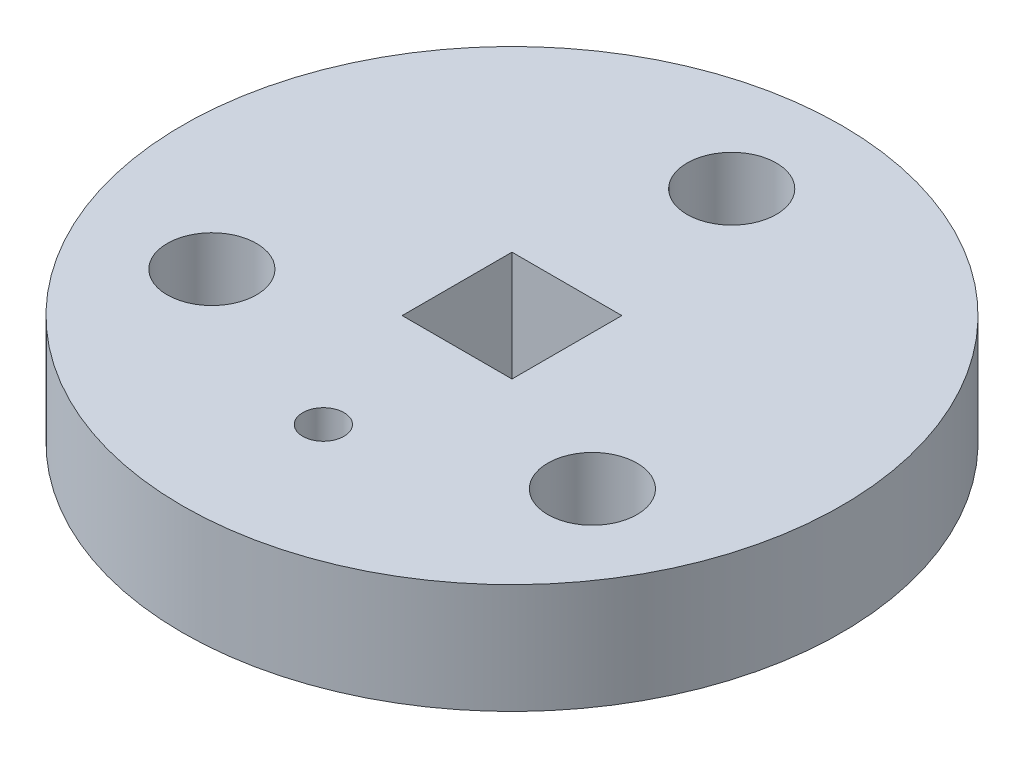
ISO-10303-21;
HEADER;
FILE_DESCRIPTION(('STEP AP214'),'2;1');
FILE_NAME('part.step','',(''),(''),'','','');
FILE_SCHEMA(('AUTOMOTIVE_DESIGN { 1 0 10303 214 1 1 1 1 }'));
ENDSEC;
DATA;
#1=APPLICATION_CONTEXT('core data for automotive mechanical design processes');
#2=APPLICATION_PROTOCOL_DEFINITION('international standard','automotive_design',2000,#1);
#3=PRODUCT_CONTEXT('',#1,'mechanical');
#4=PRODUCT('Part','Part','',(#3));
#5=PRODUCT_RELATED_PRODUCT_CATEGORY('part','',(#4));
#6=PRODUCT_DEFINITION_FORMATION('','',#4);
#7=PRODUCT_DEFINITION_CONTEXT('part definition',#1,'design');
#8=PRODUCT_DEFINITION('design','',#6,#7);
#9=PRODUCT_DEFINITION_SHAPE('','',#8);
#10=(LENGTH_UNIT() NAMED_UNIT(*) SI_UNIT(.MILLI.,.METRE.));
#11=(NAMED_UNIT(*) PLANE_ANGLE_UNIT() SI_UNIT($,.RADIAN.));
#12=(NAMED_UNIT(*) SI_UNIT($,.STERADIAN.) SOLID_ANGLE_UNIT());
#13=UNCERTAINTY_MEASURE_WITH_UNIT(LENGTH_MEASURE(1.E-05),#10,'distance_accuracy_value','');
#14=(GEOMETRIC_REPRESENTATION_CONTEXT(3) GLOBAL_UNCERTAINTY_ASSIGNED_CONTEXT((#13)) GLOBAL_UNIT_ASSIGNED_CONTEXT((#10,
#11,#12)) REPRESENTATION_CONTEXT('',''));
#15=CARTESIAN_POINT('',(0.,0.,0.));
#16=DIRECTION('',(0.,0.,1.));
#17=DIRECTION('',(1.,0.,0.));
#18=AXIS2_PLACEMENT_3D('',#15,#16,#17);
#19=CARTESIAN_POINT('',(0.,6.35,0.));
#20=DIRECTION('',(0.,1.,0.));
#21=DIRECTION('',(0.,0.,1.));
#22=AXIS2_PLACEMENT_3D('',#19,#20,#21);
#23=PLANE('',#22);
#24=CARTESIAN_POINT('',(10.9985226280624,6.35,6.35));
#25=DIRECTION('',(0.,1.,0.));
#26=DIRECTION('',(0.,0.,1.));
#27=AXIS2_PLACEMENT_3D('',#24,#25,#26);
#28=CIRCLE('',#27,2.5796875);
#29=CARTESIAN_POINT('',(10.9985226280624,6.35,8.9296875));
#30=VERTEX_POINT('',#29);
#31=EDGE_CURVE('E140',#30,#30,#28,.T.);
#32=ORIENTED_EDGE('',*,*,#31,.F.);
#33=EDGE_LOOP('',(#32));
#34=FACE_BOUND('',#33,.T.);
#35=DIRECTION('',(-1.,0.,0.));
#36=VECTOR('',#35,1.);
#37=CARTESIAN_POINT('',(3.175,6.35,-3.175));
#38=LINE('',#37,#36);
#39=CARTESIAN_POINT('',(3.175,6.35,-3.175));
#40=VERTEX_POINT('',#39);
#41=CARTESIAN_POINT('',(-3.175,6.35,-3.175));
#42=VERTEX_POINT('',#41);
#43=EDGE_CURVE('E82',#40,#42,#38,.T.);
#44=ORIENTED_EDGE('',*,*,#43,.F.);
#45=DIRECTION('',(0.,0.,-1.));
#46=VECTOR('',#45,1.);
#47=CARTESIAN_POINT('',(3.175,6.35,3.175));
#48=LINE('',#47,#46);
#49=CARTESIAN_POINT('',(3.175,6.35,3.175));
#50=VERTEX_POINT('',#49);
#51=EDGE_CURVE('E74',#50,#40,#48,.T.);
#52=ORIENTED_EDGE('',*,*,#51,.F.);
#53=DIRECTION('',(1.,0.,0.));
#54=VECTOR('',#53,1.);
#55=CARTESIAN_POINT('',(3.175,6.35,3.175));
#56=LINE('',#55,#54);
#57=CARTESIAN_POINT('',(-3.175,6.35,3.175));
#58=VERTEX_POINT('',#57);
#59=EDGE_CURVE('E97',#58,#50,#56,.T.);
#60=ORIENTED_EDGE('',*,*,#59,.F.);
#61=DIRECTION('',(0.,0.,1.));
#62=VECTOR('',#61,1.);
#63=CARTESIAN_POINT('',(-3.175,6.35,3.175));
#64=LINE('',#63,#62);
#65=EDGE_CURVE('E95',#42,#58,#64,.T.);
#66=ORIENTED_EDGE('',*,*,#65,.F.);
#67=EDGE_LOOP('',(#44,#52,#60,#66));
#68=FACE_BOUND('',#67,.T.);
#69=CARTESIAN_POINT('',(0.,6.35,-12.7));
#70=DIRECTION('',(0.,1.,0.));
#71=DIRECTION('',(0.,0.,1.));
#72=AXIS2_PLACEMENT_3D('',#69,#70,#71);
#73=CIRCLE('',#72,2.5796875);
#74=CARTESIAN_POINT('',(0.,6.35,-10.1203125));
#75=VERTEX_POINT('',#74);
#76=EDGE_CURVE('E113',#75,#75,#73,.T.);
#77=ORIENTED_EDGE('',*,*,#76,.F.);
#78=EDGE_LOOP('',(#77));
#79=FACE_BOUND('',#78,.T.);
#80=CARTESIAN_POINT('',(0.,6.35,0.));
#81=DIRECTION('',(0.,1.,0.));
#82=DIRECTION('',(0.,0.,1.));
#83=AXIS2_PLACEMENT_3D('',#80,#81,#82);
#84=CIRCLE('',#83,19.05);
#85=CARTESIAN_POINT('',(0.,6.35,19.05));
#86=VERTEX_POINT('',#85);
#87=EDGE_CURVE('E11',#86,#86,#84,.T.);
#88=ORIENTED_EDGE('',*,*,#87,.T.);
#89=EDGE_LOOP('',(#88));
#90=FACE_BOUND('',#89,.T.);
#91=CARTESIAN_POINT('',(0.,6.35,10.903378281309));
#92=DIRECTION('',(0.,1.,0.));
#93=DIRECTION('',(0.,0.,1.));
#94=AXIS2_PLACEMENT_3D('',#91,#92,#93);
#95=CIRCLE('',#94,1.190625);
#96=CARTESIAN_POINT('',(0.,6.35,12.094003281309));
#97=VERTEX_POINT('',#96);
#98=EDGE_CURVE('E103',#97,#97,#95,.T.);
#99=ORIENTED_EDGE('',*,*,#98,.F.);
#100=EDGE_LOOP('',(#99));
#101=FACE_BOUND('',#100,.T.);
#102=CARTESIAN_POINT('',(-10.9985226280624,6.35,6.35000000000001));
#103=DIRECTION('',(0.,1.,0.));
#104=DIRECTION('',(0.,0.,1.));
#105=AXIS2_PLACEMENT_3D('',#102,#103,#104);
#106=CIRCLE('',#105,2.5796875);
#107=CARTESIAN_POINT('',(-10.9985226280624,6.35,8.92968750000001));
#108=VERTEX_POINT('',#107);
#109=EDGE_CURVE('E147',#108,#108,#106,.T.);
#110=ORIENTED_EDGE('',*,*,#109,.F.);
#111=EDGE_LOOP('',(#110));
#112=FACE_BOUND('',#111,.T.);
#113=ADVANCED_FACE('F33',(#34,#68,#79,#90,#101,#112),#23,.T.);
#114=CARTESIAN_POINT('',(0.,0.,0.));
#115=DIRECTION('',(0.,1.,0.));
#116=DIRECTION('',(0.,0.,1.));
#117=AXIS2_PLACEMENT_3D('',#114,#115,#116);
#118=PLANE('',#117);
#119=CARTESIAN_POINT('',(0.,0.,-12.7));
#120=DIRECTION('',(0.,1.,0.));
#121=DIRECTION('',(0.,0.,1.));
#122=AXIS2_PLACEMENT_3D('',#119,#120,#121);
#123=CIRCLE('',#122,2.5796875);
#124=CARTESIAN_POINT('',(0.,0.,-10.1203125));
#125=VERTEX_POINT('',#124);
#126=EDGE_CURVE('E90',#125,#125,#123,.T.);
#127=ORIENTED_EDGE('',*,*,#126,.T.);
#128=EDGE_LOOP('',(#127));
#129=FACE_BOUND('',#128,.T.);
#130=CARTESIAN_POINT('',(0.,0.,0.));
#131=DIRECTION('',(0.,1.,0.));
#132=DIRECTION('',(0.,0.,1.));
#133=AXIS2_PLACEMENT_3D('',#130,#131,#132);
#134=CIRCLE('',#133,19.05);
#135=CARTESIAN_POINT('',(0.,0.,19.05));
#136=VERTEX_POINT('',#135);
#137=EDGE_CURVE('E37',#136,#136,#134,.T.);
#138=ORIENTED_EDGE('',*,*,#137,.F.);
#139=EDGE_LOOP('',(#138));
#140=FACE_BOUND('',#139,.T.);
#141=DIRECTION('',(0.,0.,-1.));
#142=VECTOR('',#141,1.);
#143=CARTESIAN_POINT('',(3.175,0.,3.175));
#144=LINE('',#143,#142);
#145=CARTESIAN_POINT('',(3.175,0.,3.175));
#146=VERTEX_POINT('',#145);
#147=CARTESIAN_POINT('',(3.175,0.,-3.175));
#148=VERTEX_POINT('',#147);
#149=EDGE_CURVE('E56',#146,#148,#144,.T.);
#150=ORIENTED_EDGE('',*,*,#149,.T.);
#151=DIRECTION('',(-1.,0.,0.));
#152=VECTOR('',#151,1.);
#153=CARTESIAN_POINT('',(3.175,0.,-3.175));
#154=LINE('',#153,#152);
#155=CARTESIAN_POINT('',(-3.175,0.,-3.175));
#156=VERTEX_POINT('',#155);
#157=EDGE_CURVE('E89',#148,#156,#154,.T.);
#158=ORIENTED_EDGE('',*,*,#157,.T.);
#159=DIRECTION('',(0.,0.,1.));
#160=VECTOR('',#159,1.);
#161=CARTESIAN_POINT('',(-3.175,0.,3.175));
#162=LINE('',#161,#160);
#163=CARTESIAN_POINT('',(-3.175,0.,3.175));
#164=VERTEX_POINT('',#163);
#165=EDGE_CURVE('E105',#156,#164,#162,.T.);
#166=ORIENTED_EDGE('',*,*,#165,.T.);
#167=DIRECTION('',(1.,0.,0.));
#168=VECTOR('',#167,1.);
#169=CARTESIAN_POINT('',(3.175,0.,3.175));
#170=LINE('',#169,#168);
#171=EDGE_CURVE('E83',#164,#146,#170,.T.);
#172=ORIENTED_EDGE('',*,*,#171,.T.);
#173=EDGE_LOOP('',(#150,#158,#166,#172));
#174=FACE_BOUND('',#173,.T.);
#175=CARTESIAN_POINT('',(0.,0.,10.903378281309));
#176=DIRECTION('',(0.,1.,0.));
#177=DIRECTION('',(0.,0.,1.));
#178=AXIS2_PLACEMENT_3D('',#175,#176,#177);
#179=CIRCLE('',#178,1.190625);
#180=CARTESIAN_POINT('',(0.,0.,12.094003281309));
#181=VERTEX_POINT('',#180);
#182=EDGE_CURVE('E142',#181,#181,#179,.T.);
#183=ORIENTED_EDGE('',*,*,#182,.T.);
#184=EDGE_LOOP('',(#183));
#185=FACE_BOUND('',#184,.T.);
#186=CARTESIAN_POINT('',(10.9985226280624,0.,6.35));
#187=DIRECTION('',(0.,1.,0.));
#188=DIRECTION('',(0.,0.,1.));
#189=AXIS2_PLACEMENT_3D('',#186,#187,#188);
#190=CIRCLE('',#189,2.5796875);
#191=CARTESIAN_POINT('',(10.9985226280624,0.,8.9296875));
#192=VERTEX_POINT('',#191);
#193=EDGE_CURVE('E143',#192,#192,#190,.T.);
#194=ORIENTED_EDGE('',*,*,#193,.T.);
#195=EDGE_LOOP('',(#194));
#196=FACE_BOUND('',#195,.T.);
#197=CARTESIAN_POINT('',(-10.9985226280624,0.,6.35000000000001));
#198=DIRECTION('',(0.,1.,0.));
#199=DIRECTION('',(0.,0.,1.));
#200=AXIS2_PLACEMENT_3D('',#197,#198,#199);
#201=CIRCLE('',#200,2.5796875);
#202=CARTESIAN_POINT('',(-10.9985226280624,0.,8.92968750000001));
#203=VERTEX_POINT('',#202);
#204=EDGE_CURVE('E150',#203,#203,#201,.T.);
#205=ORIENTED_EDGE('',*,*,#204,.T.);
#206=EDGE_LOOP('',(#205));
#207=FACE_BOUND('',#206,.T.);
#208=ADVANCED_FACE('F119',(#129,#140,#174,#185,#196,#207),#118,.F.);
#209=CARTESIAN_POINT('',(0.,6.35,0.));
#210=DIRECTION('',(0.,-1.,0.));
#211=DIRECTION('',(0.,0.,-1.));
#212=AXIS2_PLACEMENT_3D('',#209,#210,#211);
#213=CYLINDRICAL_SURFACE('',#212,19.05);
#214=ORIENTED_EDGE('',*,*,#87,.F.);
#215=EDGE_LOOP('',(#214));
#216=FACE_BOUND('',#215,.T.);
#217=ORIENTED_EDGE('',*,*,#137,.T.);
#218=EDGE_LOOP('',(#217));
#219=FACE_BOUND('',#218,.T.);
#220=ADVANCED_FACE('F35',(#216,#219),#213,.T.);
#221=CARTESIAN_POINT('',(0.,6.35,-12.7));
#222=DIRECTION('',(0.,-1.,0.));
#223=DIRECTION('',(0.,0.,-1.));
#224=AXIS2_PLACEMENT_3D('',#221,#222,#223);
#225=CYLINDRICAL_SURFACE('',#224,2.5796875);
#226=ORIENTED_EDGE('',*,*,#76,.T.);
#227=EDGE_LOOP('',(#226));
#228=FACE_BOUND('',#227,.T.);
#229=ORIENTED_EDGE('',*,*,#126,.F.);
#230=EDGE_LOOP('',(#229));
#231=FACE_BOUND('',#230,.T.);
#232=ADVANCED_FACE('F122',(#228,#231),#225,.F.);
#233=CARTESIAN_POINT('',(3.175,6.35,3.175));
#234=DIRECTION('',(-1.,0.,0.));
#235=DIRECTION('',(0.,0.,1.));
#236=AXIS2_PLACEMENT_3D('',#233,#234,#235);
#237=PLANE('',#236);
#238=ORIENTED_EDGE('',*,*,#149,.F.);
#239=DIRECTION('',(0.,-1.,0.));
#240=VECTOR('',#239,1.);
#241=CARTESIAN_POINT('',(3.175,6.35,3.175));
#242=LINE('',#241,#240);
#243=EDGE_CURVE('E78',#50,#146,#242,.T.);
#244=ORIENTED_EDGE('',*,*,#243,.F.);
#245=ORIENTED_EDGE('',*,*,#51,.T.);
#246=DIRECTION('',(0.,-1.,0.));
#247=VECTOR('',#246,1.);
#248=CARTESIAN_POINT('',(3.175,6.35,-3.175));
#249=LINE('',#248,#247);
#250=EDGE_CURVE('E77',#40,#148,#249,.T.);
#251=ORIENTED_EDGE('',*,*,#250,.T.);
#252=EDGE_LOOP('',(#238,#244,#245,#251));
#253=FACE_BOUND('',#252,.T.);
#254=ADVANCED_FACE('F76',(#253),#237,.T.);
#255=CARTESIAN_POINT('',(3.175,6.35,-3.175));
#256=DIRECTION('',(0.,0.,1.));
#257=DIRECTION('',(1.,0.,0.));
#258=AXIS2_PLACEMENT_3D('',#255,#256,#257);
#259=PLANE('',#258);
#260=ORIENTED_EDGE('',*,*,#157,.F.);
#261=ORIENTED_EDGE('',*,*,#250,.F.);
#262=ORIENTED_EDGE('',*,*,#43,.T.);
#263=DIRECTION('',(0.,-1.,0.));
#264=VECTOR('',#263,1.);
#265=CARTESIAN_POINT('',(-3.175,6.35,-3.175));
#266=LINE('',#265,#264);
#267=EDGE_CURVE('E91',#42,#156,#266,.T.);
#268=ORIENTED_EDGE('',*,*,#267,.T.);
#269=EDGE_LOOP('',(#260,#261,#262,#268));
#270=FACE_BOUND('',#269,.T.);
#271=ADVANCED_FACE('F86',(#270),#259,.T.);
#272=CARTESIAN_POINT('',(-3.175,6.35,3.175));
#273=DIRECTION('',(1.,0.,0.));
#274=DIRECTION('',(0.,0.,-1.));
#275=AXIS2_PLACEMENT_3D('',#272,#273,#274);
#276=PLANE('',#275);
#277=ORIENTED_EDGE('',*,*,#165,.F.);
#278=ORIENTED_EDGE('',*,*,#267,.F.);
#279=ORIENTED_EDGE('',*,*,#65,.T.);
#280=DIRECTION('',(0.,-1.,0.));
#281=VECTOR('',#280,1.);
#282=CARTESIAN_POINT('',(-3.175,6.35,3.175));
#283=LINE('',#282,#281);
#284=EDGE_CURVE('E48',#58,#164,#283,.T.);
#285=ORIENTED_EDGE('',*,*,#284,.T.);
#286=EDGE_LOOP('',(#277,#278,#279,#285));
#287=FACE_BOUND('',#286,.T.);
#288=ADVANCED_FACE('F181',(#287),#276,.T.);
#289=CARTESIAN_POINT('',(3.175,6.35,3.175));
#290=DIRECTION('',(0.,0.,-1.));
#291=DIRECTION('',(-1.,0.,0.));
#292=AXIS2_PLACEMENT_3D('',#289,#290,#291);
#293=PLANE('',#292);
#294=ORIENTED_EDGE('',*,*,#171,.F.);
#295=ORIENTED_EDGE('',*,*,#284,.F.);
#296=ORIENTED_EDGE('',*,*,#59,.T.);
#297=ORIENTED_EDGE('',*,*,#243,.T.);
#298=EDGE_LOOP('',(#294,#295,#296,#297));
#299=FACE_BOUND('',#298,.T.);
#300=ADVANCED_FACE('F177',(#299),#293,.T.);
#301=CARTESIAN_POINT('',(0.,6.35,10.903378281309));
#302=DIRECTION('',(0.,-1.,0.));
#303=DIRECTION('',(0.,0.,-1.));
#304=AXIS2_PLACEMENT_3D('',#301,#302,#303);
#305=CYLINDRICAL_SURFACE('',#304,1.190625);
#306=ORIENTED_EDGE('',*,*,#182,.F.);
#307=EDGE_LOOP('',(#306));
#308=FACE_BOUND('',#307,.T.);
#309=ORIENTED_EDGE('',*,*,#98,.T.);
#310=EDGE_LOOP('',(#309));
#311=FACE_BOUND('',#310,.T.);
#312=ADVANCED_FACE('F156',(#308,#311),#305,.F.);
#313=CARTESIAN_POINT('',(10.9985226280624,6.35,6.35));
#314=DIRECTION('',(0.,-1.,0.));
#315=DIRECTION('',(0.,0.,-1.));
#316=AXIS2_PLACEMENT_3D('',#313,#314,#315);
#317=CYLINDRICAL_SURFACE('',#316,2.5796875);
#318=ORIENTED_EDGE('',*,*,#31,.T.);
#319=EDGE_LOOP('',(#318));
#320=FACE_BOUND('',#319,.T.);
#321=ORIENTED_EDGE('',*,*,#193,.F.);
#322=EDGE_LOOP('',(#321));
#323=FACE_BOUND('',#322,.T.);
#324=ADVANCED_FACE('F168',(#320,#323),#317,.F.);
#325=CARTESIAN_POINT('',(-10.9985226280624,6.35,6.35000000000001));
#326=DIRECTION('',(0.,-1.,0.));
#327=DIRECTION('',(0.,0.,-1.));
#328=AXIS2_PLACEMENT_3D('',#325,#326,#327);
#329=CYLINDRICAL_SURFACE('',#328,2.5796875);
#330=ORIENTED_EDGE('',*,*,#109,.T.);
#331=EDGE_LOOP('',(#330));
#332=FACE_BOUND('',#331,.T.);
#333=ORIENTED_EDGE('',*,*,#204,.F.);
#334=EDGE_LOOP('',(#333));
#335=FACE_BOUND('',#334,.T.);
#336=ADVANCED_FACE('F166',(#332,#335),#329,.F.);
#337=CLOSED_SHELL('',(#113,#208,#220,#232,#254,#271,#288,#300,#312,#324,#336));
#338=MANIFOLD_SOLID_BREP('B2',#337);
#339=ADVANCED_BREP_SHAPE_REPRESENTATION('',(#18,#338),#14);
#340=SHAPE_DEFINITION_REPRESENTATION(#9,#339);
ENDSEC;
END-ISO-10303-21;
